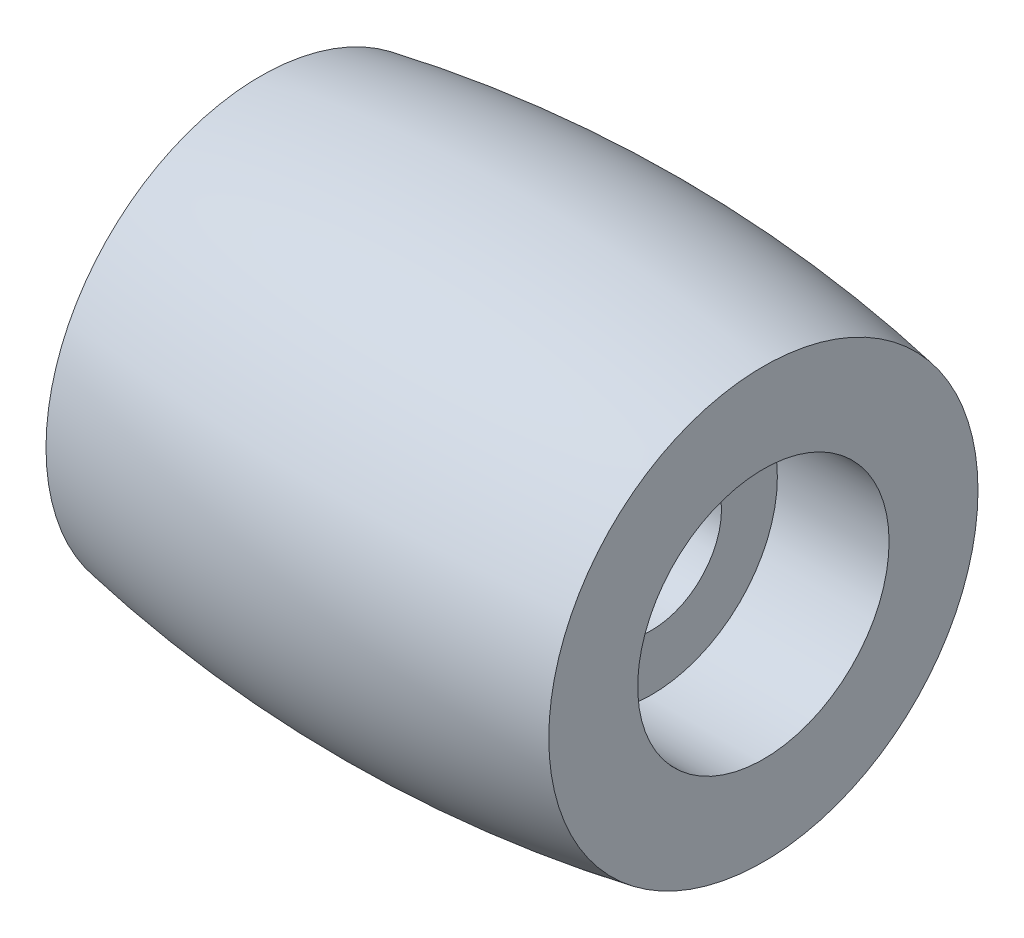
ISO-10303-21;
HEADER;
FILE_DESCRIPTION(('STEP AP214'),'2;1');
FILE_NAME('part.step','',(''),(''),'','','');
FILE_SCHEMA(('AUTOMOTIVE_DESIGN { 1 0 10303 214 1 1 1 1 }'));
ENDSEC;
DATA;
#1=APPLICATION_CONTEXT('core data for automotive mechanical design processes');
#2=APPLICATION_PROTOCOL_DEFINITION('international standard','automotive_design',2000,#1);
#3=PRODUCT_CONTEXT('',#1,'mechanical');
#4=PRODUCT('Part','Part','',(#3));
#5=PRODUCT_RELATED_PRODUCT_CATEGORY('part','',(#4));
#6=PRODUCT_DEFINITION_FORMATION('','',#4);
#7=PRODUCT_DEFINITION_CONTEXT('part definition',#1,'design');
#8=PRODUCT_DEFINITION('design','',#6,#7);
#9=PRODUCT_DEFINITION_SHAPE('','',#8);
#10=(LENGTH_UNIT() NAMED_UNIT(*) SI_UNIT(.MILLI.,.METRE.));
#11=(NAMED_UNIT(*) PLANE_ANGLE_UNIT() SI_UNIT($,.RADIAN.));
#12=(NAMED_UNIT(*) SI_UNIT($,.STERADIAN.) SOLID_ANGLE_UNIT());
#13=UNCERTAINTY_MEASURE_WITH_UNIT(LENGTH_MEASURE(1.E-05),#10,'distance_accuracy_value','');
#14=(GEOMETRIC_REPRESENTATION_CONTEXT(3) GLOBAL_UNCERTAINTY_ASSIGNED_CONTEXT((#13)) GLOBAL_UNIT_ASSIGNED_CONTEXT((#10,
#11,#12)) REPRESENTATION_CONTEXT('',''));
#15=CARTESIAN_POINT('',(0.,0.,0.));
#16=DIRECTION('',(0.,0.,1.));
#17=DIRECTION('',(1.,0.,0.));
#18=AXIS2_PLACEMENT_3D('',#15,#16,#17);
#19=CARTESIAN_POINT('',(-9.,0.,0.));
#20=DIRECTION('',(1.,0.,0.));
#21=DIRECTION('',(0.,0.,-1.));
#22=AXIS2_PLACEMENT_3D('',#19,#20,#21);
#23=CYLINDRICAL_SURFACE('',#22,2.5);
#24=CARTESIAN_POINT('',(5.,0.,0.));
#25=DIRECTION('',(1.,0.,0.));
#26=DIRECTION('',(0.,0.,-1.));
#27=AXIS2_PLACEMENT_3D('',#24,#25,#26);
#28=CIRCLE('',#27,2.5);
#29=CARTESIAN_POINT('',(5.,0.,-2.5));
#30=VERTEX_POINT('',#29);
#31=EDGE_CURVE('E45',#30,#30,#28,.F.);
#32=ORIENTED_EDGE('',*,*,#31,.F.);
#33=EDGE_LOOP('',(#32));
#34=FACE_BOUND('',#33,.T.);
#35=CARTESIAN_POINT('',(-5.,0.,0.));
#36=DIRECTION('',(-1.,0.,0.));
#37=DIRECTION('',(0.,0.,1.));
#38=AXIS2_PLACEMENT_3D('',#35,#36,#37);
#39=CIRCLE('',#38,2.5);
#40=CARTESIAN_POINT('',(-5.,0.,2.5));
#41=VERTEX_POINT('',#40);
#42=EDGE_CURVE('E36',#41,#41,#39,.F.);
#43=ORIENTED_EDGE('',*,*,#42,.F.);
#44=EDGE_LOOP('',(#43));
#45=FACE_BOUND('',#44,.T.);
#46=ADVANCED_FACE('F32',(#34,#45),#23,.F.);
#47=CARTESIAN_POINT('',(9.,0.,0.));
#48=DIRECTION('',(-1.,0.,0.));
#49=DIRECTION('',(0.,0.,1.));
#50=AXIS2_PLACEMENT_3D('',#47,#48,#49);
#51=PLANE('',#50);
#52=CARTESIAN_POINT('',(9.,0.,0.));
#53=DIRECTION('',(1.,0.,0.));
#54=DIRECTION('',(0.,0.,-1.));
#55=AXIS2_PLACEMENT_3D('',#52,#53,#54);
#56=CIRCLE('',#55,4.5);
#57=CARTESIAN_POINT('',(9.,0.,-4.5));
#58=VERTEX_POINT('',#57);
#59=EDGE_CURVE('E53',#58,#58,#56,.T.);
#60=ORIENTED_EDGE('',*,*,#59,.F.);
#61=EDGE_LOOP('',(#60));
#62=FACE_BOUND('',#61,.T.);
#63=CARTESIAN_POINT('',(9.,0.,0.));
#64=DIRECTION('',(-1.,0.,0.));
#65=DIRECTION('',(0.,0.,1.));
#66=AXIS2_PLACEMENT_3D('',#63,#64,#65);
#67=CIRCLE('',#66,7.68333050943175);
#68=CARTESIAN_POINT('',(9.,0.,7.68333050943175));
#69=VERTEX_POINT('',#68);
#70=EDGE_CURVE('E40',#69,#69,#67,.T.);
#71=ORIENTED_EDGE('',*,*,#70,.F.);
#72=EDGE_LOOP('',(#71));
#73=FACE_BOUND('',#72,.T.);
#74=ADVANCED_FACE('F34',(#62,#73),#51,.F.);
#75=CARTESIAN_POINT('',(-9.,0.,0.));
#76=DIRECTION('',(1.,0.,0.));
#77=DIRECTION('',(0.,0.,-1.));
#78=AXIS2_PLACEMENT_3D('',#75,#76,#77);
#79=PLANE('',#78);
#80=CARTESIAN_POINT('',(-9.,0.,0.));
#81=DIRECTION('',(1.,0.,0.));
#82=DIRECTION('',(0.,0.,-1.));
#83=AXIS2_PLACEMENT_3D('',#80,#81,#82);
#84=CIRCLE('',#83,4.5);
#85=CARTESIAN_POINT('',(-9.,0.,-4.5));
#86=VERTEX_POINT('',#85);
#87=EDGE_CURVE('E59',#86,#86,#84,.T.);
#88=ORIENTED_EDGE('',*,*,#87,.T.);
#89=EDGE_LOOP('',(#88));
#90=FACE_BOUND('',#89,.T.);
#91=CARTESIAN_POINT('',(-9.,0.,0.));
#92=DIRECTION('',(-1.,0.,0.));
#93=DIRECTION('',(0.,0.,1.));
#94=AXIS2_PLACEMENT_3D('',#91,#92,#93);
#95=CIRCLE('',#94,7.68333050943175);
#96=CARTESIAN_POINT('',(-9.,0.,7.68333050943175));
#97=VERTEX_POINT('',#96);
#98=EDGE_CURVE('E10',#97,#97,#95,.T.);
#99=ORIENTED_EDGE('',*,*,#98,.T.);
#100=EDGE_LOOP('',(#99));
#101=FACE_BOUND('',#100,.T.);
#102=ADVANCED_FACE('F77',(#90,#101),#79,.F.);
#103=CARTESIAN_POINT('',(0.,0.,0.));
#104=DIRECTION('',(-1.,0.,0.));
#105=DIRECTION('',(0.,0.,1.));
#106=AXIS2_PLACEMENT_3D('',#103,#104,#105);
#107=DEGENERATE_TOROIDAL_SURFACE('',#106,41.5,50.,.F.);
#108=ORIENTED_EDGE('',*,*,#98,.F.);
#109=EDGE_LOOP('',(#108));
#110=FACE_BOUND('',#109,.T.);
#111=ORIENTED_EDGE('',*,*,#70,.T.);
#112=EDGE_LOOP('',(#111));
#113=FACE_BOUND('',#112,.T.);
#114=ADVANCED_FACE('F83',(#110,#113),#107,.F.);
#115=CARTESIAN_POINT('',(5.,0.,0.));
#116=DIRECTION('',(1.,0.,0.));
#117=DIRECTION('',(0.,0.,-1.));
#118=AXIS2_PLACEMENT_3D('',#115,#116,#117);
#119=PLANE('',#118);
#120=CARTESIAN_POINT('',(5.,0.,0.));
#121=DIRECTION('',(1.,0.,0.));
#122=DIRECTION('',(0.,0.,-1.));
#123=AXIS2_PLACEMENT_3D('',#120,#121,#122);
#124=CIRCLE('',#123,4.5);
#125=CARTESIAN_POINT('',(5.,0.,-4.5));
#126=VERTEX_POINT('',#125);
#127=EDGE_CURVE('E49',#126,#126,#124,.T.);
#128=ORIENTED_EDGE('',*,*,#127,.T.);
#129=EDGE_LOOP('',(#128));
#130=FACE_BOUND('',#129,.T.);
#131=ORIENTED_EDGE('',*,*,#31,.T.);
#132=EDGE_LOOP('',(#131));
#133=FACE_BOUND('',#132,.T.);
#134=ADVANCED_FACE('F85',(#130,#133),#119,.T.);
#135=CARTESIAN_POINT('',(5.,0.,0.));
#136=DIRECTION('',(1.,0.,0.));
#137=DIRECTION('',(0.,0.,-1.));
#138=AXIS2_PLACEMENT_3D('',#135,#136,#137);
#139=CYLINDRICAL_SURFACE('',#138,4.5);
#140=ORIENTED_EDGE('',*,*,#127,.F.);
#141=EDGE_LOOP('',(#140));
#142=FACE_BOUND('',#141,.T.);
#143=ORIENTED_EDGE('',*,*,#59,.T.);
#144=EDGE_LOOP('',(#143));
#145=FACE_BOUND('',#144,.T.);
#146=ADVANCED_FACE('F81',(#142,#145),#139,.F.);
#147=CARTESIAN_POINT('',(-5.,0.,0.));
#148=DIRECTION('',(-1.,0.,0.));
#149=DIRECTION('',(0.,0.,-1.));
#150=AXIS2_PLACEMENT_3D('',#147,#148,#149);
#151=PLANE('',#150);
#152=CARTESIAN_POINT('',(-5.,0.,0.));
#153=DIRECTION('',(1.,0.,0.));
#154=DIRECTION('',(0.,0.,-1.));
#155=AXIS2_PLACEMENT_3D('',#152,#153,#154);
#156=CIRCLE('',#155,4.5);
#157=CARTESIAN_POINT('',(-5.,0.,-4.5));
#158=VERTEX_POINT('',#157);
#159=EDGE_CURVE('E62',#158,#158,#156,.T.);
#160=ORIENTED_EDGE('',*,*,#159,.F.);
#161=EDGE_LOOP('',(#160));
#162=FACE_BOUND('',#161,.T.);
#163=ORIENTED_EDGE('',*,*,#42,.T.);
#164=EDGE_LOOP('',(#163));
#165=FACE_BOUND('',#164,.T.);
#166=ADVANCED_FACE('F69',(#162,#165),#151,.T.);
#167=CARTESIAN_POINT('',(-5.,0.,0.));
#168=DIRECTION('',(-1.,0.,0.));
#169=DIRECTION('',(0.,0.,1.));
#170=AXIS2_PLACEMENT_3D('',#167,#168,#169);
#171=CYLINDRICAL_SURFACE('',#170,4.5);
#172=ORIENTED_EDGE('',*,*,#159,.T.);
#173=EDGE_LOOP('',(#172));
#174=FACE_BOUND('',#173,.T.);
#175=ORIENTED_EDGE('',*,*,#87,.F.);
#176=EDGE_LOOP('',(#175));
#177=FACE_BOUND('',#176,.T.);
#178=ADVANCED_FACE('F93',(#174,#177),#171,.F.);
#179=CLOSED_SHELL('',(#46,#74,#102,#114,#134,#146,#166,#178));
#180=MANIFOLD_SOLID_BREP('B2',#179);
#181=ADVANCED_BREP_SHAPE_REPRESENTATION('',(#18,#180),#14);
#182=SHAPE_DEFINITION_REPRESENTATION(#9,#181);
ENDSEC;
END-ISO-10303-21;
